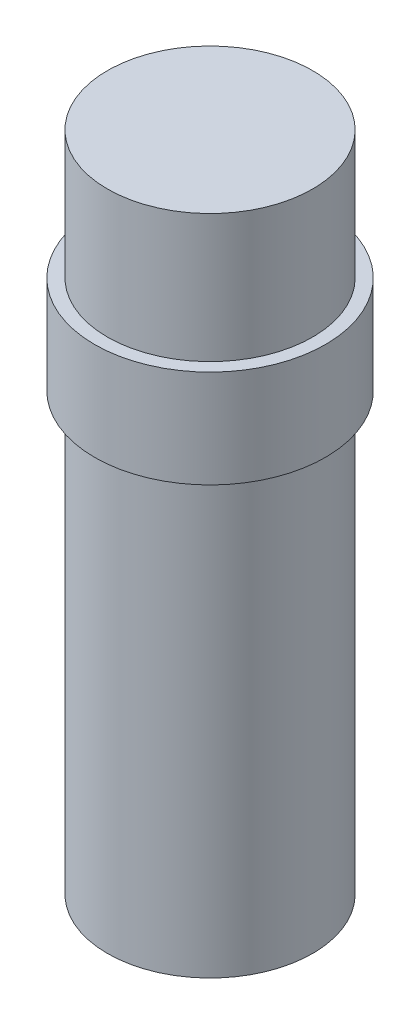
ISO-10303-21;
HEADER;
FILE_DESCRIPTION(('STEP AP214'),'2;1');
FILE_NAME('part.step','',(''),(''),'','','');
FILE_SCHEMA(('AUTOMOTIVE_DESIGN { 1 0 10303 214 1 1 1 1 }'));
ENDSEC;
DATA;
#1=APPLICATION_CONTEXT('core data for automotive mechanical design processes');
#2=APPLICATION_PROTOCOL_DEFINITION('international standard','automotive_design',2000,#1);
#3=PRODUCT_CONTEXT('',#1,'mechanical');
#4=PRODUCT('Part','Part','',(#3));
#5=PRODUCT_RELATED_PRODUCT_CATEGORY('part','',(#4));
#6=PRODUCT_DEFINITION_FORMATION('','',#4);
#7=PRODUCT_DEFINITION_CONTEXT('part definition',#1,'design');
#8=PRODUCT_DEFINITION('design','',#6,#7);
#9=PRODUCT_DEFINITION_SHAPE('','',#8);
#10=(LENGTH_UNIT() NAMED_UNIT(*) SI_UNIT(.MILLI.,.METRE.));
#11=(NAMED_UNIT(*) PLANE_ANGLE_UNIT() SI_UNIT($,.RADIAN.));
#12=(NAMED_UNIT(*) SI_UNIT($,.STERADIAN.) SOLID_ANGLE_UNIT());
#13=UNCERTAINTY_MEASURE_WITH_UNIT(LENGTH_MEASURE(1.E-05),#10,'distance_accuracy_value','');
#14=(GEOMETRIC_REPRESENTATION_CONTEXT(3) GLOBAL_UNCERTAINTY_ASSIGNED_CONTEXT((#13)) GLOBAL_UNIT_ASSIGNED_CONTEXT((#10,
#11,#12)) REPRESENTATION_CONTEXT('',''));
#15=CARTESIAN_POINT('',(0.,0.,0.));
#16=DIRECTION('',(0.,0.,1.));
#17=DIRECTION('',(1.,0.,0.));
#18=AXIS2_PLACEMENT_3D('',#15,#16,#17);
#19=CARTESIAN_POINT('',(0.,20.81,0.));
#20=DIRECTION('',(0.,1.,0.));
#21=DIRECTION('',(0.,0.,1.));
#22=AXIS2_PLACEMENT_3D('',#19,#20,#21);
#23=PLANE('',#22);
#24=CARTESIAN_POINT('',(0.,20.81,0.));
#25=DIRECTION('',(0.,1.,0.));
#26=DIRECTION('',(0.,0.,1.));
#27=AXIS2_PLACEMENT_3D('',#24,#25,#26);
#28=CIRCLE('',#27,4.5);
#29=CARTESIAN_POINT('',(0.,20.81,4.5));
#30=VERTEX_POINT('',#29);
#31=EDGE_CURVE('E41',#30,#30,#28,.T.);
#32=ORIENTED_EDGE('',*,*,#31,.T.);
#33=EDGE_LOOP('',(#32));
#34=FACE_BOUND('',#33,.T.);
#35=CARTESIAN_POINT('',(0.,20.81,0.));
#36=DIRECTION('',(0.,1.,0.));
#37=DIRECTION('',(0.,0.,1.));
#38=AXIS2_PLACEMENT_3D('',#35,#36,#37);
#39=CIRCLE('',#38,4.);
#40=CARTESIAN_POINT('',(0.,20.81,4.));
#41=VERTEX_POINT('',#40);
#42=EDGE_CURVE('E49',#41,#41,#39,.T.);
#43=ORIENTED_EDGE('',*,*,#42,.F.);
#44=EDGE_LOOP('',(#43));
#45=FACE_BOUND('',#44,.T.);
#46=ADVANCED_FACE('F30',(#34,#45),#23,.T.);
#47=CARTESIAN_POINT('',(0.,17.,0.));
#48=DIRECTION('',(0.,-1.,0.));
#49=DIRECTION('',(0.,0.,-1.));
#50=AXIS2_PLACEMENT_3D('',#47,#48,#49);
#51=CYLINDRICAL_SURFACE('',#50,4.);
#52=CARTESIAN_POINT('',(0.,17.,0.));
#53=DIRECTION('',(0.,1.,0.));
#54=DIRECTION('',(0.,0.,1.));
#55=AXIS2_PLACEMENT_3D('',#52,#53,#54);
#56=CIRCLE('',#55,4.);
#57=CARTESIAN_POINT('',(0.,17.,4.));
#58=VERTEX_POINT('',#57);
#59=EDGE_CURVE('E10',#58,#58,#56,.T.);
#60=ORIENTED_EDGE('',*,*,#59,.F.);
#61=EDGE_LOOP('',(#60));
#62=FACE_BOUND('',#61,.T.);
#63=CARTESIAN_POINT('',(0.,0.,0.));
#64=DIRECTION('',(0.,1.,0.));
#65=DIRECTION('',(0.,0.,1.));
#66=AXIS2_PLACEMENT_3D('',#63,#64,#65);
#67=CIRCLE('',#66,4.);
#68=CARTESIAN_POINT('',(0.,0.,4.));
#69=VERTEX_POINT('',#68);
#70=EDGE_CURVE('E34',#69,#69,#67,.T.);
#71=ORIENTED_EDGE('',*,*,#70,.T.);
#72=EDGE_LOOP('',(#71));
#73=FACE_BOUND('',#72,.T.);
#74=ADVANCED_FACE('F32',(#62,#73),#51,.T.);
#75=CARTESIAN_POINT('',(0.,0.,0.));
#76=DIRECTION('',(0.,1.,0.));
#77=DIRECTION('',(0.,0.,1.));
#78=AXIS2_PLACEMENT_3D('',#75,#76,#77);
#79=PLANE('',#78);
#80=ORIENTED_EDGE('',*,*,#70,.F.);
#81=EDGE_LOOP('',(#80));
#82=FACE_BOUND('',#81,.T.);
#83=ADVANCED_FACE('F70',(#82),#79,.F.);
#84=CARTESIAN_POINT('',(0.,17.,0.));
#85=DIRECTION('',(0.,1.,0.));
#86=DIRECTION('',(0.,0.,1.));
#87=AXIS2_PLACEMENT_3D('',#84,#85,#86);
#88=PLANE('',#87);
#89=CARTESIAN_POINT('',(0.,17.,0.));
#90=DIRECTION('',(0.,1.,0.));
#91=DIRECTION('',(0.,0.,1.));
#92=AXIS2_PLACEMENT_3D('',#89,#90,#91);
#93=CIRCLE('',#92,4.5);
#94=CARTESIAN_POINT('',(0.,17.,4.5));
#95=VERTEX_POINT('',#94);
#96=EDGE_CURVE('E43',#95,#95,#93,.T.);
#97=ORIENTED_EDGE('',*,*,#96,.F.);
#98=EDGE_LOOP('',(#97));
#99=FACE_BOUND('',#98,.T.);
#100=ORIENTED_EDGE('',*,*,#59,.T.);
#101=EDGE_LOOP('',(#100));
#102=FACE_BOUND('',#101,.T.);
#103=ADVANCED_FACE('F74',(#99,#102),#88,.F.);
#104=CARTESIAN_POINT('',(0.,20.81,0.));
#105=DIRECTION('',(0.,-1.,0.));
#106=DIRECTION('',(0.,0.,-1.));
#107=AXIS2_PLACEMENT_3D('',#104,#105,#106);
#108=CYLINDRICAL_SURFACE('',#107,4.5);
#109=ORIENTED_EDGE('',*,*,#31,.F.);
#110=EDGE_LOOP('',(#109));
#111=FACE_BOUND('',#110,.T.);
#112=ORIENTED_EDGE('',*,*,#96,.T.);
#113=EDGE_LOOP('',(#112));
#114=FACE_BOUND('',#113,.T.);
#115=ADVANCED_FACE('F60',(#111,#114),#108,.T.);
#116=CARTESIAN_POINT('',(0.,25.81,0.));
#117=DIRECTION('',(0.,-1.,0.));
#118=DIRECTION('',(0.,0.,-1.));
#119=AXIS2_PLACEMENT_3D('',#116,#117,#118);
#120=CYLINDRICAL_SURFACE('',#119,4.);
#121=CARTESIAN_POINT('',(0.,25.81,0.));
#122=DIRECTION('',(0.,1.,0.));
#123=DIRECTION('',(0.,0.,1.));
#124=AXIS2_PLACEMENT_3D('',#121,#122,#123);
#125=CIRCLE('',#124,4.);
#126=CARTESIAN_POINT('',(0.,25.81,4.));
#127=VERTEX_POINT('',#126);
#128=EDGE_CURVE('E46',#127,#127,#125,.T.);
#129=ORIENTED_EDGE('',*,*,#128,.F.);
#130=EDGE_LOOP('',(#129));
#131=FACE_BOUND('',#130,.T.);
#132=ORIENTED_EDGE('',*,*,#42,.T.);
#133=EDGE_LOOP('',(#132));
#134=FACE_BOUND('',#133,.T.);
#135=ADVANCED_FACE('F57',(#131,#134),#120,.T.);
#136=CARTESIAN_POINT('',(0.,25.81,0.));
#137=DIRECTION('',(0.,1.,0.));
#138=DIRECTION('',(0.,0.,1.));
#139=AXIS2_PLACEMENT_3D('',#136,#137,#138);
#140=PLANE('',#139);
#141=ORIENTED_EDGE('',*,*,#128,.T.);
#142=EDGE_LOOP('',(#141));
#143=FACE_BOUND('',#142,.T.);
#144=ADVANCED_FACE('F55',(#143),#140,.T.);
#145=CLOSED_SHELL('',(#46,#74,#83,#103,#115,#135,#144));
#146=MANIFOLD_SOLID_BREP('B2',#145);
#147=ADVANCED_BREP_SHAPE_REPRESENTATION('',(#18,#146),#14);
#148=SHAPE_DEFINITION_REPRESENTATION(#9,#147);
ENDSEC;
END-ISO-10303-21;
